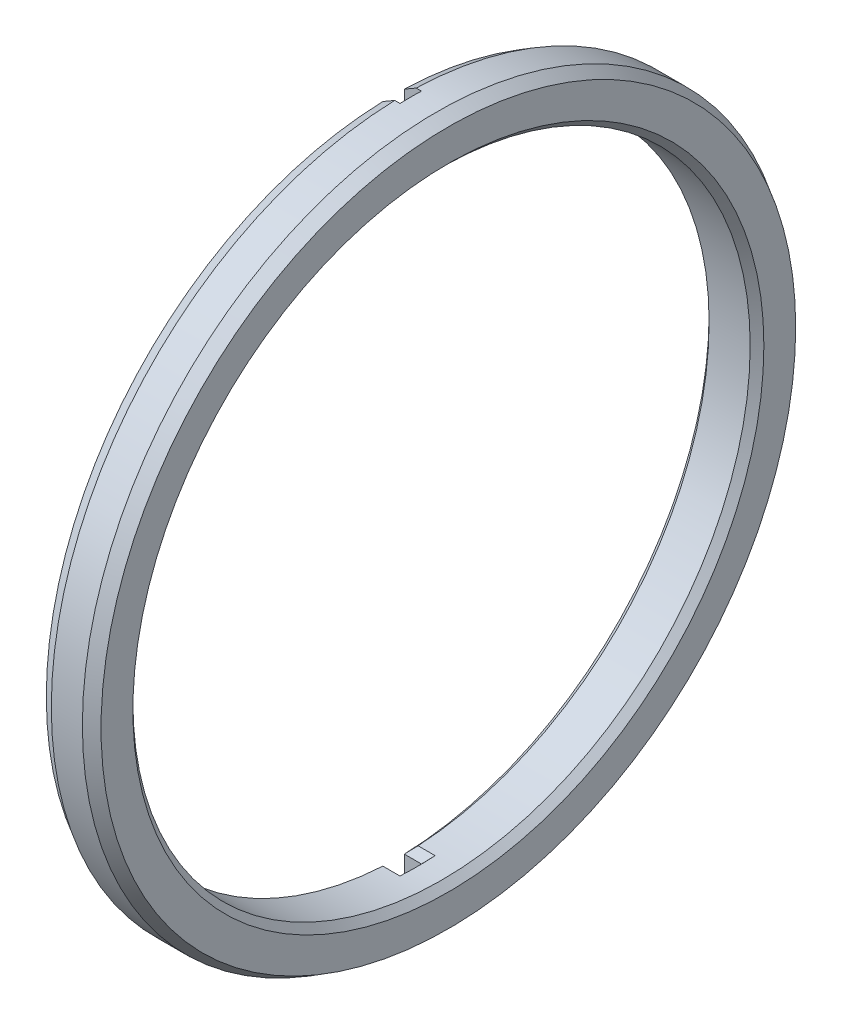
ISO-10303-21;
HEADER;
FILE_DESCRIPTION(('STEP AP214'),'2;1');
FILE_NAME('part.step','',(''),(''),'','','');
FILE_SCHEMA(('AUTOMOTIVE_DESIGN { 1 0 10303 214 1 1 1 1 }'));
ENDSEC;
DATA;
#1=APPLICATION_CONTEXT('core data for automotive mechanical design processes');
#2=APPLICATION_PROTOCOL_DEFINITION('international standard','automotive_design',2000,#1);
#3=PRODUCT_CONTEXT('',#1,'mechanical');
#4=PRODUCT('Part','Part','',(#3));
#5=PRODUCT_RELATED_PRODUCT_CATEGORY('part','',(#4));
#6=PRODUCT_DEFINITION_FORMATION('','',#4);
#7=PRODUCT_DEFINITION_CONTEXT('part definition',#1,'design');
#8=PRODUCT_DEFINITION('design','',#6,#7);
#9=PRODUCT_DEFINITION_SHAPE('','',#8);
#10=(LENGTH_UNIT() NAMED_UNIT(*) SI_UNIT(.MILLI.,.METRE.));
#11=(NAMED_UNIT(*) PLANE_ANGLE_UNIT() SI_UNIT($,.RADIAN.));
#12=(NAMED_UNIT(*) SI_UNIT($,.STERADIAN.) SOLID_ANGLE_UNIT());
#13=UNCERTAINTY_MEASURE_WITH_UNIT(LENGTH_MEASURE(1.E-05),#10,'distance_accuracy_value','');
#14=(GEOMETRIC_REPRESENTATION_CONTEXT(3) GLOBAL_UNCERTAINTY_ASSIGNED_CONTEXT((#13)) GLOBAL_UNIT_ASSIGNED_CONTEXT((#10,
#11,#12)) REPRESENTATION_CONTEXT('',''));
#15=CARTESIAN_POINT('',(0.,0.,0.));
#16=DIRECTION('',(0.,0.,1.));
#17=DIRECTION('',(1.,0.,0.));
#18=AXIS2_PLACEMENT_3D('',#15,#16,#17);
#19=CARTESIAN_POINT('',(2.032,0.,0.));
#20=DIRECTION('',(-1.,0.,0.));
#21=DIRECTION('',(0.,0.,1.));
#22=AXIS2_PLACEMENT_3D('',#19,#20,#21);
#23=CYLINDRICAL_SURFACE('',#22,13.1445);
#24=CARTESIAN_POINT('',(1.59257999999999,0.,0.));
#25=DIRECTION('',(1.,0.,0.));
#26=DIRECTION('',(0.,0.,-1.));
#27=AXIS2_PLACEMENT_3D('',#24,#25,#26);
#28=CIRCLE('',#27,13.1445);
#29=CARTESIAN_POINT('',(1.59257999999999,0.,-13.1445));
#30=VERTEX_POINT('',#29);
#31=EDGE_CURVE('E195',#30,#30,#28,.F.);
#32=ORIENTED_EDGE('',*,*,#31,.T.);
#33=EDGE_LOOP('',(#32));
#34=FACE_BOUND('',#33,.T.);
#35=DIRECTION('',(-1.,0.,0.));
#36=VECTOR('',#35,1.);
#37=CARTESIAN_POINT('',(0.635,13.1385071634632,0.396874999999998));
#38=LINE('',#37,#36);
#39=CARTESIAN_POINT('',(0.635,13.1385071634632,0.396874999999998));
#40=VERTEX_POINT('',#39);
#41=CARTESIAN_POINT('',(0.439420000000001,13.1385071634632,0.396874999999998));
#42=VERTEX_POINT('',#41);
#43=EDGE_CURVE('E172',#40,#42,#38,.T.);
#44=ORIENTED_EDGE('',*,*,#43,.T.);
#45=CARTESIAN_POINT('',(0.439419999999999,0.,0.));
#46=DIRECTION('',(1.,0.,0.));
#47=DIRECTION('',(0.,0.,-1.));
#48=AXIS2_PLACEMENT_3D('',#45,#46,#47);
#49=CIRCLE('',#48,13.1445);
#50=CARTESIAN_POINT('',(0.439420000000001,-13.1385071634632,0.396874999999998));
#51=VERTEX_POINT('',#50);
#52=EDGE_CURVE('E199',#42,#51,#49,.T.);
#53=ORIENTED_EDGE('',*,*,#52,.T.);
#54=DIRECTION('',(-1.,0.,0.));
#55=VECTOR('',#54,1.);
#56=CARTESIAN_POINT('',(0.635,-13.1385071634632,0.396874999999998));
#57=LINE('',#56,#55);
#58=CARTESIAN_POINT('',(0.635,-13.1385071634632,0.396874999999998));
#59=VERTEX_POINT('',#58);
#60=EDGE_CURVE('E189',#59,#51,#57,.T.);
#61=ORIENTED_EDGE('',*,*,#60,.F.);
#62=CARTESIAN_POINT('',(0.635,0.,0.));
#63=DIRECTION('',(1.,0.,0.));
#64=DIRECTION('',(0.,0.,-1.));
#65=AXIS2_PLACEMENT_3D('',#62,#63,#64);
#66=CIRCLE('',#65,13.1445);
#67=CARTESIAN_POINT('',(0.635,-13.1385071634632,-0.396874999999999));
#68=VERTEX_POINT('',#67);
#69=EDGE_CURVE('E181',#59,#68,#66,.T.);
#70=ORIENTED_EDGE('',*,*,#69,.T.);
#71=DIRECTION('',(-1.,0.,0.));
#72=VECTOR('',#71,1.);
#73=CARTESIAN_POINT('',(0.635,-13.1385071634632,-0.396874999999999));
#74=LINE('',#73,#72);
#75=CARTESIAN_POINT('',(0.439420000000001,-13.1385071634632,-0.396874999999999));
#76=VERTEX_POINT('',#75);
#77=EDGE_CURVE('E185',#68,#76,#74,.T.);
#78=ORIENTED_EDGE('',*,*,#77,.T.);
#79=CARTESIAN_POINT('',(0.439419999999999,0.,0.));
#80=DIRECTION('',(1.,0.,0.));
#81=DIRECTION('',(0.,0.,-1.));
#82=AXIS2_PLACEMENT_3D('',#79,#80,#81);
#83=CIRCLE('',#82,13.1445);
#84=CARTESIAN_POINT('',(0.439420000000001,13.1385071634632,-0.396874999999999));
#85=VERTEX_POINT('',#84);
#86=EDGE_CURVE('E170',#76,#85,#83,.T.);
#87=ORIENTED_EDGE('',*,*,#86,.T.);
#88=DIRECTION('',(-1.,0.,0.));
#89=VECTOR('',#88,1.);
#90=CARTESIAN_POINT('',(0.635,13.1385071634632,-0.396874999999999));
#91=LINE('',#90,#89);
#92=CARTESIAN_POINT('',(0.635,13.1385071634632,-0.396874999999999));
#93=VERTEX_POINT('',#92);
#94=EDGE_CURVE('E152',#93,#85,#91,.T.);
#95=ORIENTED_EDGE('',*,*,#94,.F.);
#96=CARTESIAN_POINT('',(0.635,0.,0.));
#97=DIRECTION('',(1.,0.,0.));
#98=DIRECTION('',(0.,0.,-1.));
#99=AXIS2_PLACEMENT_3D('',#96,#97,#98);
#100=CIRCLE('',#99,13.1445);
#101=EDGE_CURVE('E156',#93,#40,#100,.T.);
#102=ORIENTED_EDGE('',*,*,#101,.T.);
#103=EDGE_LOOP('',(#44,#53,#61,#70,#78,#87,#95,#102));
#104=FACE_BOUND('',#103,.T.);
#105=ADVANCED_FACE('F16',(#34,#104),#23,.T.);
#106=CARTESIAN_POINT('',(2.032,0.,0.));
#107=DIRECTION('',(-1.,0.,0.));
#108=DIRECTION('',(0.,0.,1.));
#109=AXIS2_PLACEMENT_3D('',#106,#107,#108);
#110=CYLINDRICAL_SURFACE('',#109,11.4554);
#111=CARTESIAN_POINT('',(0.253999999999999,0.,0.));
#112=DIRECTION('',(1.,0.,0.));
#113=DIRECTION('',(0.,0.,-1.));
#114=AXIS2_PLACEMENT_3D('',#111,#112,#113);
#115=CIRCLE('',#114,11.4554);
#116=CARTESIAN_POINT('',(0.253999999999999,-11.4367385704286,0.653605409762341));
#117=VERTEX_POINT('',#116);
#118=CARTESIAN_POINT('',(0.253999999999999,11.4367385704286,0.653605409762343));
#119=VERTEX_POINT('',#118);
#120=EDGE_CURVE('E395',#117,#119,#115,.F.);
#121=ORIENTED_EDGE('',*,*,#120,.T.);
#122=DIRECTION('',(-1.,0.,0.));
#123=VECTOR('',#122,1.);
#124=CARTESIAN_POINT('',(2.032,11.4367385704286,0.653605409762343));
#125=LINE('',#124,#123);
#126=CARTESIAN_POINT('',(0.888999999999999,11.4367385704286,0.653605409762343));
#127=VERTEX_POINT('',#126);
#128=EDGE_CURVE('E397',#119,#127,#125,.F.);
#129=ORIENTED_EDGE('',*,*,#128,.T.);
#130=CARTESIAN_POINT('',(0.888999999999999,0.,0.));
#131=DIRECTION('',(1.,0.,0.));
#132=DIRECTION('',(0.,0.,-1.));
#133=AXIS2_PLACEMENT_3D('',#130,#131,#132);
#134=CIRCLE('',#133,11.4554);
#135=CARTESIAN_POINT('',(0.888999999999999,11.4367385704286,-0.653605409762338));
#136=VERTEX_POINT('',#135);
#137=EDGE_CURVE('E381',#127,#136,#134,.F.);
#138=ORIENTED_EDGE('',*,*,#137,.T.);
#139=DIRECTION('',(-1.,0.,0.));
#140=VECTOR('',#139,1.);
#141=CARTESIAN_POINT('',(2.032,11.4367385704286,-0.653605409762338));
#142=LINE('',#141,#140);
#143=CARTESIAN_POINT('',(0.253999999999999,11.4367385704286,-0.653605409762338));
#144=VERTEX_POINT('',#143);
#145=EDGE_CURVE('E382',#136,#144,#142,.T.);
#146=ORIENTED_EDGE('',*,*,#145,.T.);
#147=CARTESIAN_POINT('',(0.253999999999999,0.,0.));
#148=DIRECTION('',(1.,0.,0.));
#149=DIRECTION('',(0.,0.,-1.));
#150=AXIS2_PLACEMENT_3D('',#147,#148,#149);
#151=CIRCLE('',#150,11.4554);
#152=CARTESIAN_POINT('',(0.253999999999999,-11.4367385704286,-0.653605409762342));
#153=VERTEX_POINT('',#152);
#154=EDGE_CURVE('E387',#144,#153,#151,.F.);
#155=ORIENTED_EDGE('',*,*,#154,.T.);
#156=DIRECTION('',(-1.,0.,0.));
#157=VECTOR('',#156,1.);
#158=CARTESIAN_POINT('',(2.032,-11.4367385704286,-0.653605409762342));
#159=LINE('',#158,#157);
#160=CARTESIAN_POINT('',(0.888999999999999,-11.4367385704286,-0.653605409762342));
#161=VERTEX_POINT('',#160);
#162=EDGE_CURVE('E389',#153,#161,#159,.F.);
#163=ORIENTED_EDGE('',*,*,#162,.T.);
#164=CARTESIAN_POINT('',(0.888999999999999,0.,0.));
#165=DIRECTION('',(1.,0.,0.));
#166=DIRECTION('',(0.,0.,-1.));
#167=AXIS2_PLACEMENT_3D('',#164,#165,#166);
#168=CIRCLE('',#167,11.4554);
#169=CARTESIAN_POINT('',(0.888999999999999,-11.4367385704286,0.653605409762341));
#170=VERTEX_POINT('',#169);
#171=EDGE_CURVE('E391',#161,#170,#168,.F.);
#172=ORIENTED_EDGE('',*,*,#171,.T.);
#173=DIRECTION('',(-1.,0.,0.));
#174=VECTOR('',#173,1.);
#175=CARTESIAN_POINT('',(2.032,-11.4367385704286,0.653605409762341));
#176=LINE('',#175,#174);
#177=EDGE_CURVE('E393',#170,#117,#176,.T.);
#178=ORIENTED_EDGE('',*,*,#177,.T.);
#179=EDGE_LOOP('',(#121,#129,#138,#146,#155,#163,#172,#178));
#180=FACE_BOUND('',#179,.T.);
#181=CARTESIAN_POINT('',(1.77800000000001,0.,0.));
#182=DIRECTION('',(1.,0.,0.));
#183=DIRECTION('',(0.,0.,-1.));
#184=AXIS2_PLACEMENT_3D('',#181,#182,#183);
#185=CIRCLE('',#184,11.4554);
#186=CARTESIAN_POINT('',(1.77800000000001,0.,-11.4554));
#187=VERTEX_POINT('',#186);
#188=EDGE_CURVE('E379',#187,#187,#185,.T.);
#189=ORIENTED_EDGE('',*,*,#188,.T.);
#190=EDGE_LOOP('',(#189));
#191=FACE_BOUND('',#190,.T.);
#192=ADVANCED_FACE('F436',(#180,#191),#110,.F.);
#193=CARTESIAN_POINT('',(0.,0.,-29.0593213562373));
#194=DIRECTION('',(1.,0.,0.));
#195=DIRECTION('',(0.,0.,-1.));
#196=AXIS2_PLACEMENT_3D('',#193,#194,#195);
#197=PLANE('',#196);
#198=DIRECTION('',(0.,-1.,0.));
#199=VECTOR('',#198,1.);
#200=CARTESIAN_POINT('',(0.,0.,-0.396874999999997));
#201=LINE('',#200,#199);
#202=CARTESIAN_POINT('',(0.,-11.7026722843278,-0.396874999999999));
#203=VERTEX_POINT('',#202);
#204=CARTESIAN_POINT('',(0.,-12.8843890225488,-0.396874999999999));
#205=VERTEX_POINT('',#204);
#206=EDGE_CURVE('E174',#203,#205,#201,.T.);
#207=ORIENTED_EDGE('',*,*,#206,.F.);
#208=CARTESIAN_POINT('',(0.,0.,0.));
#209=DIRECTION('',(1.,0.,0.));
#210=DIRECTION('',(0.,0.,-1.));
#211=AXIS2_PLACEMENT_3D('',#208,#209,#210);
#212=CIRCLE('',#211,11.7094);
#213=CARTESIAN_POINT('',(0.,11.7026722843278,-0.396874999999999));
#214=VERTEX_POINT('',#213);
#215=EDGE_CURVE('E361',#203,#214,#212,.T.);
#216=ORIENTED_EDGE('',*,*,#215,.T.);
#217=DIRECTION('',(0.,1.,0.));
#218=VECTOR('',#217,1.);
#219=CARTESIAN_POINT('',(0.,0.,-0.396874999999997));
#220=LINE('',#219,#218);
#221=CARTESIAN_POINT('',(0.,12.8843890225488,-0.396874999999999));
#222=VERTEX_POINT('',#221);
#223=EDGE_CURVE('E424',#214,#222,#220,.T.);
#224=ORIENTED_EDGE('',*,*,#223,.T.);
#225=CARTESIAN_POINT('',(0.,0.,0.));
#226=DIRECTION('',(1.,0.,0.));
#227=DIRECTION('',(0.,0.,-1.));
#228=AXIS2_PLACEMENT_3D('',#225,#226,#227);
#229=CIRCLE('',#228,12.8905);
#230=EDGE_CURVE('E443',#222,#205,#229,.F.);
#231=ORIENTED_EDGE('',*,*,#230,.T.);
#232=EDGE_LOOP('',(#207,#216,#224,#231));
#233=FACE_BOUND('',#232,.T.);
#234=ADVANCED_FACE('F441',(#233),#197,.F.);
#235=DIRECTION('',(0.,-1.,0.));
#236=VECTOR('',#235,1.);
#237=CARTESIAN_POINT('',(0.,0.,0.396875));
#238=LINE('',#237,#236);
#239=CARTESIAN_POINT('',(0.,12.8843890225488,0.396874999999998));
#240=VERTEX_POINT('',#239);
#241=CARTESIAN_POINT('',(0.,11.7026722843278,0.396874999999999));
#242=VERTEX_POINT('',#241);
#243=EDGE_CURVE('E157',#240,#242,#238,.T.);
#244=ORIENTED_EDGE('',*,*,#243,.T.);
#245=CARTESIAN_POINT('',(0.,0.,0.));
#246=DIRECTION('',(1.,0.,0.));
#247=DIRECTION('',(0.,0.,-1.));
#248=AXIS2_PLACEMENT_3D('',#245,#246,#247);
#249=CIRCLE('',#248,11.7094);
#250=CARTESIAN_POINT('',(0.,-11.7026722843278,0.396874999999999));
#251=VERTEX_POINT('',#250);
#252=EDGE_CURVE('E400',#242,#251,#249,.T.);
#253=ORIENTED_EDGE('',*,*,#252,.T.);
#254=DIRECTION('',(0.,-1.,0.));
#255=VECTOR('',#254,1.);
#256=CARTESIAN_POINT('',(0.,0.,0.396875));
#257=LINE('',#256,#255);
#258=CARTESIAN_POINT('',(0.,-12.8843890225488,0.396874999999998));
#259=VERTEX_POINT('',#258);
#260=EDGE_CURVE('E171',#251,#259,#257,.T.);
#261=ORIENTED_EDGE('',*,*,#260,.T.);
#262=CARTESIAN_POINT('',(0.,0.,0.));
#263=DIRECTION('',(1.,0.,0.));
#264=DIRECTION('',(0.,0.,-1.));
#265=AXIS2_PLACEMENT_3D('',#262,#263,#264);
#266=CIRCLE('',#265,12.8905);
#267=EDGE_CURVE('E210',#259,#240,#266,.F.);
#268=ORIENTED_EDGE('',*,*,#267,.T.);
#269=EDGE_LOOP('',(#244,#253,#261,#268));
#270=FACE_BOUND('',#269,.T.);
#271=ADVANCED_FACE('F470',(#270),#197,.F.);
#272=CARTESIAN_POINT('',(2.032,0.,-29.0593213562373));
#273=DIRECTION('',(1.,0.,0.));
#274=DIRECTION('',(0.,0.,-1.));
#275=AXIS2_PLACEMENT_3D('',#272,#273,#274);
#276=PLANE('',#275);
#277=CARTESIAN_POINT('',(2.032,0.,0.));
#278=DIRECTION('',(1.,0.,0.));
#279=DIRECTION('',(0.,0.,-1.));
#280=AXIS2_PLACEMENT_3D('',#277,#278,#279);
#281=CIRCLE('',#280,11.7094);
#282=CARTESIAN_POINT('',(2.032,0.,-11.7094));
#283=VERTEX_POINT('',#282);
#284=EDGE_CURVE('E340',#283,#283,#281,.F.);
#285=ORIENTED_EDGE('',*,*,#284,.T.);
#286=EDGE_LOOP('',(#285));
#287=FACE_BOUND('',#286,.T.);
#288=CARTESIAN_POINT('',(2.032,0.,0.));
#289=DIRECTION('',(1.,0.,0.));
#290=DIRECTION('',(0.,0.,-1.));
#291=AXIS2_PLACEMENT_3D('',#288,#289,#290);
#292=CIRCLE('',#291,12.8905);
#293=CARTESIAN_POINT('',(2.032,0.,-12.8905));
#294=VERTEX_POINT('',#293);
#295=EDGE_CURVE('E192',#294,#294,#292,.T.);
#296=ORIENTED_EDGE('',*,*,#295,.T.);
#297=EDGE_LOOP('',(#296));
#298=FACE_BOUND('',#297,.T.);
#299=ADVANCED_FACE('F372',(#287,#298),#276,.T.);
#300=CARTESIAN_POINT('',(0.635,0.,0.396875));
#301=DIRECTION('',(0.,0.,-1.));
#302=DIRECTION('',(0.,1.,0.));
#303=AXIS2_PLACEMENT_3D('',#300,#301,#302);
#304=PLANE('',#303);
#305=ORIENTED_EDGE('',*,*,#260,.F.);
#306=CARTESIAN_POINT('',(0.,-11.7026722843278,0.396874999999999));
#307=CARTESIAN_POINT('',(2.4862694895759E-05,-11.7026474073395,0.396874999999999));
#308=CARTESIAN_POINT('',(4.97253897916626E-05,-11.7026225303512,0.396874999999999));
#309=CARTESIAN_POINT('',(9.94507795834698E-05,-11.7025727763746,0.396874999999999));
#310=CARTESIAN_POINT('',(0.000124313474479373,-11.7025478993862,0.396874999999999));
#311=CARTESIAN_POINT('',(0.000149176169375422,-11.7025230223979,0.396874999999999));
#312=B_SPLINE_CURVE_WITH_KNOTS('',3,(#306,#307,#308,#309,#310,#311),.UNSPECIFIED.,.F.,.F.,(4,2,
4),(0.,0.000105513806248405,0.000211027612495582),.UNSPECIFIED.);
#313=CARTESIAN_POINT('',(0.000149176169375598,-11.7025230223979,0.396874999999999));
#314=VERTEX_POINT('',#313);
#315=EDGE_CURVE('E403',#251,#314,#312,.T.);
#316=ORIENTED_EDGE('',*,*,#315,.T.);
#317=DIRECTION('',(1.,0.,0.));
#318=VECTOR('',#317,1.);
#319=CARTESIAN_POINT('',(0.635,-11.7025230223979,0.396874999999999));
#320=LINE('',#319,#318);
#321=CARTESIAN_POINT('',(0.635149176169376,-11.7025230223979,0.396874999999999));
#322=VERTEX_POINT('',#321);
#323=EDGE_CURVE('E402',#314,#322,#320,.T.);
#324=ORIENTED_EDGE('',*,*,#323,.T.);
#325=CARTESIAN_POINT('',(0.635149176169376,-11.7025230223979,0.396874999999999));
#326=CARTESIAN_POINT('',(0.63512431347448,-11.7025478993862,0.396874999999999));
#327=CARTESIAN_POINT('',(0.635099450779584,-11.7025727763746,0.396874999999999));
#328=CARTESIAN_POINT('',(0.635049725389792,-11.7026225303512,0.396874999999999));
#329=CARTESIAN_POINT('',(0.635024862694896,-11.7026474073395,0.396874999999999));
#330=CARTESIAN_POINT('',(0.635,-11.7026722843278,0.396874999999999));
#331=B_SPLINE_CURVE_WITH_KNOTS('',3,(#325,#326,#327,#328,#329,#330),.UNSPECIFIED.,.F.,.F.,(4,2,
4),(0.,0.00010551380624724,0.000211027612495784),.UNSPECIFIED.);
#332=CARTESIAN_POINT('',(0.635,-11.7026722843278,0.396874999999999));
#333=VERTEX_POINT('',#332);
#334=EDGE_CURVE('E339',#322,#333,#331,.T.);
#335=ORIENTED_EDGE('',*,*,#334,.T.);
#336=DIRECTION('',(0.,-1.,0.));
#337=VECTOR('',#336,1.);
#338=CARTESIAN_POINT('',(0.635,0.,0.396875));
#339=LINE('',#338,#337);
#340=EDGE_CURVE('E179',#333,#59,#339,.T.);
#341=ORIENTED_EDGE('',*,*,#340,.T.);
#342=ORIENTED_EDGE('',*,*,#60,.T.);
#343=CARTESIAN_POINT('',(0.439419999999999,-13.1385071634632,0.396874999999998));
#344=CARTESIAN_POINT('',(0.366183166717385,-13.0961544280891,0.396874999999998));
#345=CARTESIAN_POINT('',(0.292946416742746,-13.0538015486591,0.396874999999998));
#346=CARTESIAN_POINT('',(0.146473083409413,-12.9690955016876,0.396874999999998));
#347=CARTESIAN_POINT('',(0.0732365000507189,-12.9267423341461,0.396874999999998));
#348=CARTESIAN_POINT('',(0.,-12.8843890225488,0.396874999999998));
#349=B_SPLINE_CURVE_WITH_KNOTS('',3,(#343,#344,#345,#346,#347,#348),.UNSPECIFIED.,.F.,.F.,(4,2,
4),(0.,0.25380404150782,0.507608083015659),.UNSPECIFIED.);
#350=EDGE_CURVE('E202',#51,#259,#349,.T.);
#351=ORIENTED_EDGE('',*,*,#350,.T.);
#352=EDGE_LOOP('',(#305,#316,#324,#335,#341,#342,#351));
#353=FACE_BOUND('',#352,.T.);
#354=ADVANCED_FACE('F212',(#353),#304,.T.);
#355=CARTESIAN_POINT('',(0.635,0.,-0.396874999999997));
#356=DIRECTION('',(0.,0.,-1.));
#357=DIRECTION('',(0.,1.,0.));
#358=AXIS2_PLACEMENT_3D('',#355,#356,#357);
#359=PLANE('',#358);
#360=CARTESIAN_POINT('',(0.635,-11.7026722843278,-0.396874999999999));
#361=CARTESIAN_POINT('',(0.635024862694897,-11.7026474073395,-0.396874999999999));
#362=CARTESIAN_POINT('',(0.635049725389793,-11.7026225303512,-0.396874999999999));
#363=CARTESIAN_POINT('',(0.635099450779586,-11.7025727763746,-0.396874999999999));
#364=CARTESIAN_POINT('',(0.635124313474483,-11.7025478993862,-0.396874999999999));
#365=CARTESIAN_POINT('',(0.635149176169379,-11.7025230223979,-0.396874999999999));
#366=B_SPLINE_CURVE_WITH_KNOTS('',3,(#360,#361,#362,#363,#364,#365),.UNSPECIFIED.,.F.,.F.,(4,2,
4),(0.,0.000105513806249617,0.000211027612500537),.UNSPECIFIED.);
#367=CARTESIAN_POINT('',(0.635,-11.7026722843278,-0.396874999999999));
#368=VERTEX_POINT('',#367);
#369=CARTESIAN_POINT('',(0.635149176169379,-11.7025230223979,-0.396874999999999));
#370=VERTEX_POINT('',#369);
#371=EDGE_CURVE('E334',#368,#370,#366,.T.);
#372=ORIENTED_EDGE('',*,*,#371,.T.);
#373=DIRECTION('',(-1.,0.,0.));
#374=VECTOR('',#373,1.);
#375=CARTESIAN_POINT('',(0.,-11.7025230223979,-0.396874999999999));
#376=LINE('',#375,#374);
#377=CARTESIAN_POINT('',(0.000149176169379067,-11.7025230223979,-0.396874999999999));
#378=VERTEX_POINT('',#377);
#379=EDGE_CURVE('E44',#370,#378,#376,.T.);
#380=ORIENTED_EDGE('',*,*,#379,.T.);
#381=CARTESIAN_POINT('',(0.000149176169379067,-11.7025230223979,-0.396874999999999));
#382=CARTESIAN_POINT('',(0.000124313474482679,-11.7025478993862,-0.396874999999999));
#383=CARTESIAN_POINT('',(9.94507795861469E-05,-11.7025727763746,-0.396874999999999));
#384=CARTESIAN_POINT('',(4.97253897930824E-05,-11.7026225303512,-0.396874999999999));
#385=CARTESIAN_POINT('',(2.48626948965501E-05,-11.7026474073395,-0.396874999999999));
#386=CARTESIAN_POINT('',(0.,-11.7026722843278,-0.396874999999999));
#387=B_SPLINE_CURVE_WITH_KNOTS('',3,(#381,#382,#383,#384,#385,#386),.UNSPECIFIED.,.F.,.F.,(4,2,
4),(0.,0.000105513806250965,0.000211027612500703),.UNSPECIFIED.);
#388=EDGE_CURVE('E353',#378,#203,#387,.T.);
#389=ORIENTED_EDGE('',*,*,#388,.T.);
#390=ORIENTED_EDGE('',*,*,#206,.T.);
#391=CARTESIAN_POINT('',(0.,-12.8843890225488,-0.396874999999999));
#392=CARTESIAN_POINT('',(0.0732365000507185,-12.9267423341461,-0.396874999999999));
#393=CARTESIAN_POINT('',(0.146473083409412,-12.9690955016876,-0.396874999999999));
#394=CARTESIAN_POINT('',(0.292946416742746,-13.0538015486591,-0.396874999999999));
#395=CARTESIAN_POINT('',(0.366183166717385,-13.0961544280891,-0.396874999999999));
#396=CARTESIAN_POINT('',(0.43942,-13.1385071634632,-0.396874999999999));
#397=B_SPLINE_CURVE_WITH_KNOTS('',3,(#391,#392,#393,#394,#395,#396),.UNSPECIFIED.,.F.,.F.,(4,2,
4),(0.,0.253804041507839,0.507608083015658),.UNSPECIFIED.);
#398=EDGE_CURVE('E258',#205,#76,#397,.T.);
#399=ORIENTED_EDGE('',*,*,#398,.T.);
#400=ORIENTED_EDGE('',*,*,#77,.F.);
#401=DIRECTION('',(0.,-1.,0.));
#402=VECTOR('',#401,1.);
#403=CARTESIAN_POINT('',(0.635,0.,-0.396874999999997));
#404=LINE('',#403,#402);
#405=EDGE_CURVE('E184',#368,#68,#404,.T.);
#406=ORIENTED_EDGE('',*,*,#405,.F.);
#407=EDGE_LOOP('',(#372,#380,#389,#390,#399,#400,#406));
#408=FACE_BOUND('',#407,.T.);
#409=ADVANCED_FACE('F345',(#408),#359,.F.);
#410=CARTESIAN_POINT('',(0.635,0.,0.));
#411=DIRECTION('',(1.,0.,0.));
#412=DIRECTION('',(0.,0.,-1.));
#413=AXIS2_PLACEMENT_3D('',#410,#411,#412);
#414=PLANE('',#413);
#415=ORIENTED_EDGE('',*,*,#340,.F.);
#416=CARTESIAN_POINT('',(0.635,0.,0.));
#417=DIRECTION('',(1.,0.,0.));
#418=DIRECTION('',(0.,0.,-1.));
#419=AXIS2_PLACEMENT_3D('',#416,#417,#418);
#420=CIRCLE('',#419,11.7094);
#421=EDGE_CURVE('E359',#333,#368,#420,.T.);
#422=ORIENTED_EDGE('',*,*,#421,.T.);
#423=ORIENTED_EDGE('',*,*,#405,.T.);
#424=ORIENTED_EDGE('',*,*,#69,.F.);
#425=EDGE_LOOP('',(#415,#422,#423,#424));
#426=FACE_BOUND('',#425,.T.);
#427=ADVANCED_FACE('F348',(#426),#414,.F.);
#428=CARTESIAN_POINT('',(0.635,0.,-0.396874999999997));
#429=DIRECTION('',(0.,0.,1.));
#430=DIRECTION('',(0.,-1.,0.));
#431=AXIS2_PLACEMENT_3D('',#428,#429,#430);
#432=PLANE('',#431);
#433=ORIENTED_EDGE('',*,*,#223,.F.);
#434=CARTESIAN_POINT('',(0.,11.7026722843278,-0.396874999999999));
#435=CARTESIAN_POINT('',(2.48626948966264E-05,11.7026474073395,-0.396874999999999));
#436=CARTESIAN_POINT('',(4.97253897931083E-05,11.7026225303512,-0.396874999999999));
#437=CARTESIAN_POINT('',(9.94507795860721E-05,11.7025727763746,-0.396874999999999));
#438=CARTESIAN_POINT('',(0.000124313474482554,11.7025478993862,-0.396874999999999));
#439=CARTESIAN_POINT('',(0.000149176169378891,11.7025230223979,-0.396874999999999));
#440=B_SPLINE_CURVE_WITH_KNOTS('',3,(#434,#435,#436,#437,#438,#439),.UNSPECIFIED.,.F.,.F.,(4,2,
4),(0.,0.000105513806249631,0.000211027612500489),.UNSPECIFIED.);
#441=CARTESIAN_POINT('',(0.000149176169379067,11.7025230223979,-0.396874999999999));
#442=VERTEX_POINT('',#441);
#443=EDGE_CURVE('E364',#214,#442,#440,.T.);
#444=ORIENTED_EDGE('',*,*,#443,.T.);
#445=DIRECTION('',(1.,0.,0.));
#446=VECTOR('',#445,1.);
#447=CARTESIAN_POINT('',(0.635,11.7025230223979,-0.396874999999999));
#448=LINE('',#447,#446);
#449=CARTESIAN_POINT('',(0.635149176169379,11.7025230223979,-0.396874999999999));
#450=VERTEX_POINT('',#449);
#451=EDGE_CURVE('E36',#442,#450,#448,.T.);
#452=ORIENTED_EDGE('',*,*,#451,.T.);
#453=CARTESIAN_POINT('',(0.635149176169379,11.7025230223979,-0.396874999999999));
#454=CARTESIAN_POINT('',(0.635124313474483,11.7025478993862,-0.396874999999999));
#455=CARTESIAN_POINT('',(0.635099450779586,11.7025727763746,-0.396874999999999));
#456=CARTESIAN_POINT('',(0.635049725389793,11.7026225303512,-0.396874999999999));
#457=CARTESIAN_POINT('',(0.635024862694897,11.7026474073395,-0.396874999999999));
#458=CARTESIAN_POINT('',(0.635,11.7026722843278,-0.396874999999999));
#459=B_SPLINE_CURVE_WITH_KNOTS('',3,(#453,#454,#455,#456,#457,#458),.UNSPECIFIED.,.F.,.F.,(4,2,
4),(0.,0.00010551380625092,0.00021102761250069),.UNSPECIFIED.);
#460=CARTESIAN_POINT('',(0.635,11.7026722843278,-0.396874999999999));
#461=VERTEX_POINT('',#460);
#462=EDGE_CURVE('E10',#450,#461,#459,.T.);
#463=ORIENTED_EDGE('',*,*,#462,.T.);
#464=DIRECTION('',(0.,1.,0.));
#465=VECTOR('',#464,1.);
#466=CARTESIAN_POINT('',(0.635,0.,-0.396874999999997));
#467=LINE('',#466,#465);
#468=EDGE_CURVE('E146',#461,#93,#467,.T.);
#469=ORIENTED_EDGE('',*,*,#468,.T.);
#470=ORIENTED_EDGE('',*,*,#94,.T.);
#471=CARTESIAN_POINT('',(0.439419999999999,13.1385071634632,-0.396874999999999));
#472=CARTESIAN_POINT('',(0.366183166717385,13.0961544280891,-0.396874999999999));
#473=CARTESIAN_POINT('',(0.292946416742746,13.0538015486591,-0.396874999999999));
#474=CARTESIAN_POINT('',(0.146473083409413,12.9690955016876,-0.396874999999999));
#475=CARTESIAN_POINT('',(0.0732365000507189,12.9267423341461,-0.396874999999999));
#476=CARTESIAN_POINT('',(0.,12.8843890225488,-0.396874999999999));
#477=B_SPLINE_CURVE_WITH_KNOTS('',3,(#471,#472,#473,#474,#475,#476),.UNSPECIFIED.,.F.,.F.,(4,2,
4),(0.,0.25380404150782,0.507608083015659),.UNSPECIFIED.);
#478=EDGE_CURVE('E234',#85,#222,#477,.T.);
#479=ORIENTED_EDGE('',*,*,#478,.T.);
#480=EDGE_LOOP('',(#433,#444,#452,#463,#469,#470,#479));
#481=FACE_BOUND('',#480,.T.);
#482=ADVANCED_FACE('F149',(#481),#432,.T.);
#483=CARTESIAN_POINT('',(0.635,0.,0.396875));
#484=DIRECTION('',(0.,0.,-1.));
#485=DIRECTION('',(0.,1.,0.));
#486=AXIS2_PLACEMENT_3D('',#483,#484,#485);
#487=PLANE('',#486);
#488=DIRECTION('',(0.,-1.,0.));
#489=VECTOR('',#488,1.);
#490=CARTESIAN_POINT('',(0.635,0.,0.396875));
#491=LINE('',#490,#489);
#492=CARTESIAN_POINT('',(0.635,11.7026722843278,0.396874999999999));
#493=VERTEX_POINT('',#492);
#494=EDGE_CURVE('E163',#40,#493,#491,.T.);
#495=ORIENTED_EDGE('',*,*,#494,.T.);
#496=CARTESIAN_POINT('',(0.635,11.7026722843278,0.396874999999999));
#497=CARTESIAN_POINT('',(0.635024862694897,11.7026474073395,0.396874999999999));
#498=CARTESIAN_POINT('',(0.635049725389793,11.7026225303512,0.396874999999999));
#499=CARTESIAN_POINT('',(0.635099450779586,11.7025727763746,0.396874999999999));
#500=CARTESIAN_POINT('',(0.635124313474483,11.7025478993862,0.396874999999999));
#501=CARTESIAN_POINT('',(0.635149176169379,11.7025230223979,0.396874999999999));
#502=B_SPLINE_CURVE_WITH_KNOTS('',3,(#496,#497,#498,#499,#500,#501),.UNSPECIFIED.,.F.,.F.,(4,2,
4),(0.,0.000105513806250997,0.00021102761250207),.UNSPECIFIED.);
#503=CARTESIAN_POINT('',(0.635149176169379,11.7025230223979,0.396874999999999));
#504=VERTEX_POINT('',#503);
#505=EDGE_CURVE('E29',#493,#504,#502,.T.);
#506=ORIENTED_EDGE('',*,*,#505,.T.);
#507=DIRECTION('',(-1.,0.,0.));
#508=VECTOR('',#507,1.);
#509=CARTESIAN_POINT('',(0.635,11.7025230223979,0.396874999999999));
#510=LINE('',#509,#508);
#511=CARTESIAN_POINT('',(0.000149176169379066,11.7025230223979,0.396874999999999));
#512=VERTEX_POINT('',#511);
#513=EDGE_CURVE('E257',#504,#512,#510,.T.);
#514=ORIENTED_EDGE('',*,*,#513,.T.);
#515=CARTESIAN_POINT('',(0.000149176169379066,11.7025230223979,0.396874999999999));
#516=CARTESIAN_POINT('',(0.000124313474482678,11.7025478993862,0.396874999999999));
#517=CARTESIAN_POINT('',(9.94507795861457E-05,11.7025727763746,0.396874999999999));
#518=CARTESIAN_POINT('',(4.97253897930813E-05,11.7026225303512,0.396874999999999));
#519=CARTESIAN_POINT('',(2.48626948965491E-05,11.7026474073395,0.396874999999999));
#520=CARTESIAN_POINT('',(0.,11.7026722843278,0.396874999999999));
#521=B_SPLINE_CURVE_WITH_KNOTS('',3,(#515,#516,#517,#518,#519,#520),.UNSPECIFIED.,.F.,.F.,(4,2,
4),(0.,0.000105513806250965,0.000211027612500703),.UNSPECIFIED.);
#522=EDGE_CURVE('E251',#512,#242,#521,.T.);
#523=ORIENTED_EDGE('',*,*,#522,.T.);
#524=ORIENTED_EDGE('',*,*,#243,.F.);
#525=CARTESIAN_POINT('',(0.,12.8843890225488,0.396874999999998));
#526=CARTESIAN_POINT('',(0.0732365000507185,12.9267423341461,0.396874999999998));
#527=CARTESIAN_POINT('',(0.146473083409412,12.9690955016876,0.396874999999998));
#528=CARTESIAN_POINT('',(0.292946416742746,13.0538015486591,0.396874999999998));
#529=CARTESIAN_POINT('',(0.366183166717385,13.0961544280891,0.396874999999998));
#530=CARTESIAN_POINT('',(0.43942,13.1385071634632,0.396874999999998));
#531=B_SPLINE_CURVE_WITH_KNOTS('',3,(#525,#526,#527,#528,#529,#530),.UNSPECIFIED.,.F.,.F.,(4,2,
4),(0.,0.253804041507839,0.507608083015658),.UNSPECIFIED.);
#532=EDGE_CURVE('E228',#240,#42,#531,.T.);
#533=ORIENTED_EDGE('',*,*,#532,.T.);
#534=ORIENTED_EDGE('',*,*,#43,.F.);
#535=EDGE_LOOP('',(#495,#506,#514,#523,#524,#533,#534));
#536=FACE_BOUND('',#535,.T.);
#537=ADVANCED_FACE('F240',(#536),#487,.T.);
#538=CARTESIAN_POINT('',(0.635,0.,0.));
#539=DIRECTION('',(1.,0.,0.));
#540=DIRECTION('',(0.,0.,-1.));
#541=AXIS2_PLACEMENT_3D('',#538,#539,#540);
#542=PLANE('',#541);
#543=ORIENTED_EDGE('',*,*,#468,.F.);
#544=CARTESIAN_POINT('',(0.635,0.,0.));
#545=DIRECTION('',(1.,0.,0.));
#546=DIRECTION('',(0.,0.,-1.));
#547=AXIS2_PLACEMENT_3D('',#544,#545,#546);
#548=CIRCLE('',#547,11.7094);
#549=EDGE_CURVE('E368',#461,#493,#548,.T.);
#550=ORIENTED_EDGE('',*,*,#549,.T.);
#551=ORIENTED_EDGE('',*,*,#494,.F.);
#552=ORIENTED_EDGE('',*,*,#101,.F.);
#553=EDGE_LOOP('',(#543,#550,#551,#552));
#554=FACE_BOUND('',#553,.T.);
#555=ADVANCED_FACE('F161',(#554),#542,.F.);
#556=CARTESIAN_POINT('',(2.032,0.,0.));
#557=DIRECTION('',(-1.,0.,0.));
#558=DIRECTION('',(0.,0.,1.));
#559=AXIS2_PLACEMENT_3D('',#556,#557,#558);
#560=CONICAL_SURFACE('',#559,12.8905,0.52411193314262);
#561=ORIENTED_EDGE('',*,*,#31,.F.);
#562=EDGE_LOOP('',(#561));
#563=FACE_BOUND('',#562,.T.);
#564=ORIENTED_EDGE('',*,*,#295,.F.);
#565=EDGE_LOOP('',(#564));
#566=FACE_BOUND('',#565,.T.);
#567=ADVANCED_FACE('F222',(#563,#566),#560,.T.);
#568=CARTESIAN_POINT('',(0.439419999999999,0.,0.));
#569=DIRECTION('',(1.,0.,0.));
#570=DIRECTION('',(0.,0.,-1.));
#571=AXIS2_PLACEMENT_3D('',#568,#569,#570);
#572=CONICAL_SURFACE('',#571,13.1445,0.524111933142621);
#573=ORIENTED_EDGE('',*,*,#532,.F.);
#574=ORIENTED_EDGE('',*,*,#267,.F.);
#575=ORIENTED_EDGE('',*,*,#350,.F.);
#576=ORIENTED_EDGE('',*,*,#52,.F.);
#577=EDGE_LOOP('',(#573,#574,#575,#576));
#578=FACE_BOUND('',#577,.T.);
#579=ADVANCED_FACE('F216',(#578),#572,.T.);
#580=CARTESIAN_POINT('',(0.439419999999999,0.,0.));
#581=DIRECTION('',(1.,0.,0.));
#582=DIRECTION('',(0.,0.,-1.));
#583=AXIS2_PLACEMENT_3D('',#580,#581,#582);
#584=CONICAL_SURFACE('',#583,13.1445,0.524111933142621);
#585=ORIENTED_EDGE('',*,*,#398,.F.);
#586=ORIENTED_EDGE('',*,*,#230,.F.);
#587=ORIENTED_EDGE('',*,*,#478,.F.);
#588=ORIENTED_EDGE('',*,*,#86,.F.);
#589=EDGE_LOOP('',(#585,#586,#587,#588));
#590=FACE_BOUND('',#589,.T.);
#591=ADVANCED_FACE('F221',(#590),#584,.T.);
#592=CARTESIAN_POINT('',(2.032,-11.7025230223979,-0.396874999999999));
#593=DIRECTION('',(0.,-0.694749871242897,-0.719251427810872));
#594=DIRECTION('',(0.,0.719251427810872,-0.694749871242897));
#595=AXIS2_PLACEMENT_3D('',#592,#593,#594);
#596=PLANE('',#595);
#597=CARTESIAN_POINT('',(0.635149176169379,-11.7025230223979,-0.396874999999999));
#598=CARTESIAN_POINT('',(0.677810136025225,-11.6583997827528,-0.439495165740315));
#599=CARTESIAN_POINT('',(0.720294849389631,-11.6141894605951,-0.482199447496362));
#600=CARTESIAN_POINT('',(0.804911790729776,-11.5255946433033,-0.56777625072028));
#601=CARTESIAN_POINT('',(0.847044018642243,-11.4812101481379,-0.610648772218346));
#602=CARTESIAN_POINT('',(0.888999999999999,-11.4367385704286,-0.653605409762342));
#603=B_SPLINE_CURVE_WITH_KNOTS('',3,(#597,#598,#599,#600,#601,#602),.UNSPECIFIED.,.F.,.F.,(4,2,
4),(0.,0.224161620749842,0.448323281735865),.UNSPECIFIED.);
#604=EDGE_CURVE('E329',#161,#370,#603,.F.);
#605=ORIENTED_EDGE('',*,*,#604,.F.);
#606=ORIENTED_EDGE('',*,*,#162,.F.);
#607=CARTESIAN_POINT('',(0.000149176169379067,-11.7025230223979,-0.396874999999999));
#608=CARTESIAN_POINT('',(0.0428101360252251,-11.6583997827528,-0.439495165740315));
#609=CARTESIAN_POINT('',(0.0852948493896309,-11.6141894605951,-0.482199447496362));
#610=CARTESIAN_POINT('',(0.169911790729776,-11.5255946433033,-0.56777625072028));
#611=CARTESIAN_POINT('',(0.212044018642243,-11.4812101481379,-0.610648772218346));
#612=CARTESIAN_POINT('',(0.253999999999999,-11.4367385704286,-0.653605409762342));
#613=B_SPLINE_CURVE_WITH_KNOTS('',3,(#607,#608,#609,#610,#611,#612),.UNSPECIFIED.,.F.,.F.,(4,2,
4),(0.,0.224161620749842,0.448323281735865),.UNSPECIFIED.);
#614=EDGE_CURVE('E20',#378,#153,#613,.T.);
#615=ORIENTED_EDGE('',*,*,#614,.F.);
#616=ORIENTED_EDGE('',*,*,#379,.F.);
#617=EDGE_LOOP('',(#605,#606,#615,#616));
#618=FACE_BOUND('',#617,.T.);
#619=ADVANCED_FACE('F437',(#618),#596,.F.);
#620=CARTESIAN_POINT('',(0.,0.,0.));
#621=DIRECTION('',(-1.,0.,0.));
#622=DIRECTION('',(0.,0.,1.));
#623=AXIS2_PLACEMENT_3D('',#620,#621,#622);
#624=CONICAL_SURFACE('',#623,11.7094,0.785398163397452);
#625=ORIENTED_EDGE('',*,*,#614,.T.);
#626=ORIENTED_EDGE('',*,*,#154,.F.);
#627=CARTESIAN_POINT('',(0.000149176169379067,11.7025230223979,-0.396874999999999));
#628=CARTESIAN_POINT('',(0.0428101360252251,11.6583997827528,-0.439495165740314));
#629=CARTESIAN_POINT('',(0.0852948493896309,11.6141894605951,-0.482199447496361));
#630=CARTESIAN_POINT('',(0.169911790729776,11.5255946433033,-0.567776250720277));
#631=CARTESIAN_POINT('',(0.212044018642243,11.4812101481379,-0.610648772218343));
#632=CARTESIAN_POINT('',(0.253999999999999,11.4367385704286,-0.653605409762338));
#633=B_SPLINE_CURVE_WITH_KNOTS('',3,(#627,#628,#629,#630,#631,#632),.UNSPECIFIED.,.F.,.F.,(4,2,
4),(0.,0.224161620749841,0.448323281735863),.UNSPECIFIED.);
#634=EDGE_CURVE('E315',#442,#144,#633,.T.);
#635=ORIENTED_EDGE('',*,*,#634,.F.);
#636=ORIENTED_EDGE('',*,*,#443,.F.);
#637=ORIENTED_EDGE('',*,*,#215,.F.);
#638=ORIENTED_EDGE('',*,*,#388,.F.);
#639=EDGE_LOOP('',(#625,#626,#635,#636,#637,#638));
#640=FACE_BOUND('',#639,.T.);
#641=ADVANCED_FACE('F322',(#640),#624,.F.);
#642=CARTESIAN_POINT('',(0.635,0.,0.));
#643=DIRECTION('',(-1.,0.,0.));
#644=DIRECTION('',(0.,0.,1.));
#645=AXIS2_PLACEMENT_3D('',#642,#643,#644);
#646=CONICAL_SURFACE('',#645,11.7094,0.785398163397452);
#647=ORIENTED_EDGE('',*,*,#421,.F.);
#648=ORIENTED_EDGE('',*,*,#334,.F.);
#649=CARTESIAN_POINT('',(0.635149176169376,-11.7025230223979,0.396874999999999));
#650=CARTESIAN_POINT('',(0.677810136025223,-11.6583997827528,0.439495165740314));
#651=CARTESIAN_POINT('',(0.72029484938963,-11.6141894605951,0.482199447496361));
#652=CARTESIAN_POINT('',(0.804911790729776,-11.5255946433033,0.567776250720278));
#653=CARTESIAN_POINT('',(0.847044018642243,-11.4812101481379,0.610648772218345));
#654=CARTESIAN_POINT('',(0.888999999999999,-11.4367385704286,0.653605409762341));
#655=B_SPLINE_CURVE_WITH_KNOTS('',3,(#649,#650,#651,#652,#653,#654),.UNSPECIFIED.,.F.,.F.,(4,2,
4),(0.,0.224161620749844,0.448323281735869),.UNSPECIFIED.);
#656=EDGE_CURVE('E309',#170,#322,#655,.F.);
#657=ORIENTED_EDGE('',*,*,#656,.F.);
#658=ORIENTED_EDGE('',*,*,#171,.F.);
#659=ORIENTED_EDGE('',*,*,#604,.T.);
#660=ORIENTED_EDGE('',*,*,#371,.F.);
#661=EDGE_LOOP('',(#647,#648,#657,#658,#659,#660));
#662=FACE_BOUND('',#661,.T.);
#663=ADVANCED_FACE('F319',(#662),#646,.F.);
#664=CARTESIAN_POINT('',(2.032,11.4367385704286,-0.653605409762338));
#665=DIRECTION('',(0.,0.694749871242892,-0.719251427810876));
#666=DIRECTION('',(0.,0.719251427810876,0.694749871242892));
#667=AXIS2_PLACEMENT_3D('',#664,#665,#666);
#668=PLANE('',#667);
#669=ORIENTED_EDGE('',*,*,#634,.T.);
#670=ORIENTED_EDGE('',*,*,#145,.F.);
#671=CARTESIAN_POINT('',(0.635149176169379,11.7025230223979,-0.396874999999999));
#672=CARTESIAN_POINT('',(0.677810136025225,11.6583997827528,-0.439495165740314));
#673=CARTESIAN_POINT('',(0.720294849389631,11.6141894605951,-0.482199447496361));
#674=CARTESIAN_POINT('',(0.804911790729776,11.5255946433033,-0.567776250720277));
#675=CARTESIAN_POINT('',(0.847044018642243,11.4812101481379,-0.610648772218343));
#676=CARTESIAN_POINT('',(0.888999999999999,11.4367385704286,-0.653605409762338));
#677=B_SPLINE_CURVE_WITH_KNOTS('',3,(#671,#672,#673,#674,#675,#676),.UNSPECIFIED.,.F.,.F.,(4,2,
4),(0.,0.224161620749841,0.448323281735863),.UNSPECIFIED.);
#678=EDGE_CURVE('E290',#450,#136,#677,.T.);
#679=ORIENTED_EDGE('',*,*,#678,.F.);
#680=ORIENTED_EDGE('',*,*,#451,.F.);
#681=EDGE_LOOP('',(#669,#670,#679,#680));
#682=FACE_BOUND('',#681,.T.);
#683=ADVANCED_FACE('F303',(#682),#668,.F.);
#684=CARTESIAN_POINT('',(2.032,-11.4367385704286,0.653605409762341));
#685=DIRECTION('',(0.,-0.694749871242892,0.719251427810877));
#686=DIRECTION('',(0.,-0.719251427810877,-0.694749871242892));
#687=AXIS2_PLACEMENT_3D('',#684,#685,#686);
#688=PLANE('',#687);
#689=ORIENTED_EDGE('',*,*,#656,.T.);
#690=ORIENTED_EDGE('',*,*,#323,.F.);
#691=CARTESIAN_POINT('',(0.000149176169375597,-11.7025230223979,0.396874999999999));
#692=CARTESIAN_POINT('',(0.0428101360252229,-11.6583997827528,0.439495165740314));
#693=CARTESIAN_POINT('',(0.0852948493896297,-11.6141894605951,0.482199447496361));
#694=CARTESIAN_POINT('',(0.169911790729775,-11.5255946433033,0.567776250720278));
#695=CARTESIAN_POINT('',(0.212044018642243,-11.4812101481379,0.610648772218345));
#696=CARTESIAN_POINT('',(0.253999999999999,-11.4367385704286,0.653605409762341));
#697=B_SPLINE_CURVE_WITH_KNOTS('',3,(#691,#692,#693,#694,#695,#696),.UNSPECIFIED.,.F.,.F.,(4,2,
4),(0.,0.224161620749844,0.448323281735869),.UNSPECIFIED.);
#698=EDGE_CURVE('E283',#117,#314,#697,.F.);
#699=ORIENTED_EDGE('',*,*,#698,.F.);
#700=ORIENTED_EDGE('',*,*,#177,.F.);
#701=EDGE_LOOP('',(#689,#690,#699,#700));
#702=FACE_BOUND('',#701,.T.);
#703=ADVANCED_FACE('F300',(#702),#688,.F.);
#704=CARTESIAN_POINT('',(0.635,0.,0.));
#705=DIRECTION('',(-1.,0.,0.));
#706=DIRECTION('',(0.,0.,1.));
#707=AXIS2_PLACEMENT_3D('',#704,#705,#706);
#708=CONICAL_SURFACE('',#707,11.7094,0.785398163397452);
#709=ORIENTED_EDGE('',*,*,#678,.T.);
#710=ORIENTED_EDGE('',*,*,#137,.F.);
#711=CARTESIAN_POINT('',(0.888999999999999,11.4367385704286,0.653605409762343));
#712=CARTESIAN_POINT('',(0.847044018642243,11.4812101481379,0.610648772218347));
#713=CARTESIAN_POINT('',(0.804911790729776,11.5255946433033,0.56777625072028));
#714=CARTESIAN_POINT('',(0.720294849389631,11.6141894605951,0.482199447496362));
#715=CARTESIAN_POINT('',(0.677810136025225,11.6583997827528,0.439495165740314));
#716=CARTESIAN_POINT('',(0.635149176169379,11.7025230223979,0.396874999999998));
#717=B_SPLINE_CURVE_WITH_KNOTS('',3,(#711,#712,#713,#714,#715,#716),.UNSPECIFIED.,.F.,.F.,(4,2,
4),(0.,0.224161660986024,0.448323281735866),.UNSPECIFIED.);
#718=EDGE_CURVE('E291',#504,#127,#717,.F.);
#719=ORIENTED_EDGE('',*,*,#718,.F.);
#720=ORIENTED_EDGE('',*,*,#505,.F.);
#721=ORIENTED_EDGE('',*,*,#549,.F.);
#722=ORIENTED_EDGE('',*,*,#462,.F.);
#723=EDGE_LOOP('',(#709,#710,#719,#720,#721,#722));
#724=FACE_BOUND('',#723,.T.);
#725=ADVANCED_FACE('F268',(#724),#708,.F.);
#726=CARTESIAN_POINT('',(0.,0.,0.));
#727=DIRECTION('',(-1.,0.,0.));
#728=DIRECTION('',(0.,0.,1.));
#729=AXIS2_PLACEMENT_3D('',#726,#727,#728);
#730=CONICAL_SURFACE('',#729,11.7094,0.785398163397452);
#731=ORIENTED_EDGE('',*,*,#252,.F.);
#732=ORIENTED_EDGE('',*,*,#522,.F.);
#733=CARTESIAN_POINT('',(0.000149176169379066,11.7025230223979,0.396874999999999));
#734=CARTESIAN_POINT('',(0.0428101360252251,11.6583997827528,0.439495165740315));
#735=CARTESIAN_POINT('',(0.0852948493896309,11.6141894605951,0.482199447496362));
#736=CARTESIAN_POINT('',(0.169911790729776,11.5255946433033,0.56777625072028));
#737=CARTESIAN_POINT('',(0.212044018642243,11.4812101481379,0.610648772218347));
#738=CARTESIAN_POINT('',(0.253999999999999,11.4367385704286,0.653605409762342));
#739=B_SPLINE_CURVE_WITH_KNOTS('',3,(#733,#734,#735,#736,#737,#738),.UNSPECIFIED.,.F.,.F.,(4,2,
4),(0.,0.224161620749842,0.448323281735866),.UNSPECIFIED.);
#740=EDGE_CURVE('E275',#119,#512,#739,.F.);
#741=ORIENTED_EDGE('',*,*,#740,.F.);
#742=ORIENTED_EDGE('',*,*,#120,.F.);
#743=ORIENTED_EDGE('',*,*,#698,.T.);
#744=ORIENTED_EDGE('',*,*,#315,.F.);
#745=EDGE_LOOP('',(#731,#732,#741,#742,#743,#744));
#746=FACE_BOUND('',#745,.T.);
#747=ADVANCED_FACE('F263',(#746),#730,.F.);
#748=CARTESIAN_POINT('',(2.032,11.7025230223979,0.396874999999999));
#749=DIRECTION('',(0.,0.694749871242899,0.71925142781087));
#750=DIRECTION('',(0.,-0.71925142781087,0.694749871242899));
#751=AXIS2_PLACEMENT_3D('',#748,#749,#750);
#752=PLANE('',#751);
#753=ORIENTED_EDGE('',*,*,#718,.T.);
#754=ORIENTED_EDGE('',*,*,#128,.F.);
#755=ORIENTED_EDGE('',*,*,#740,.T.);
#756=ORIENTED_EDGE('',*,*,#513,.F.);
#757=EDGE_LOOP('',(#753,#754,#755,#756));
#758=FACE_BOUND('',#757,.T.);
#759=ADVANCED_FACE('F267',(#758),#752,.F.);
#760=CARTESIAN_POINT('',(1.77800000000001,0.,0.));
#761=DIRECTION('',(1.,0.,0.));
#762=DIRECTION('',(0.,0.,-1.));
#763=AXIS2_PLACEMENT_3D('',#760,#761,#762);
#764=CONICAL_SURFACE('',#763,11.4554,0.785398163397448);
#765=ORIENTED_EDGE('',*,*,#284,.F.);
#766=EDGE_LOOP('',(#765));
#767=FACE_BOUND('',#766,.T.);
#768=ORIENTED_EDGE('',*,*,#188,.F.);
#769=EDGE_LOOP('',(#768));
#770=FACE_BOUND('',#769,.T.);
#771=ADVANCED_FACE('F18',(#767,#770),#764,.F.);
#772=CLOSED_SHELL('',(#105,#192,#234,#271,#299,#354,#409,#427,#482,#537,#555,#567,#579,#591,
#619,#641,#663,#683,#703,#725,#747,#759,#771));
#773=MANIFOLD_SOLID_BREP('B1',#772);
#774=ADVANCED_BREP_SHAPE_REPRESENTATION('',(#18,#773),#14);
#775=SHAPE_DEFINITION_REPRESENTATION(#9,#774);
ENDSEC;
END-ISO-10303-21;
